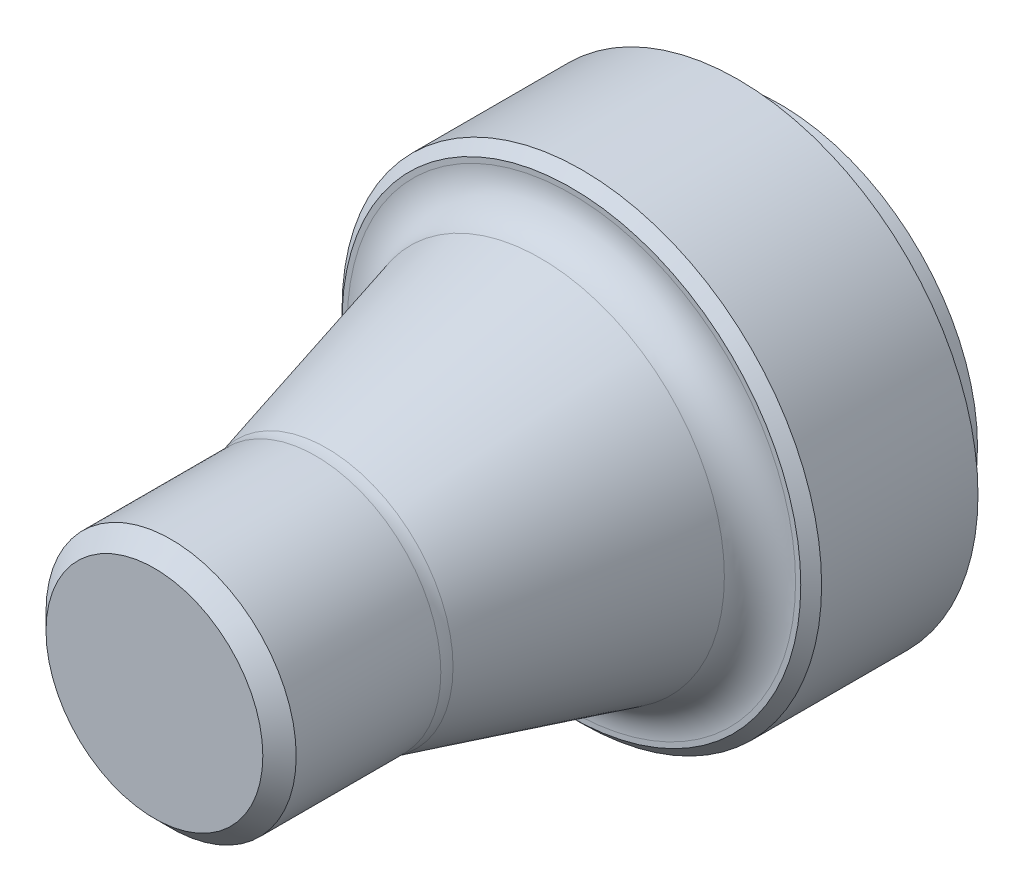
ISO-10303-21;
HEADER;
FILE_DESCRIPTION(('STEP AP214'),'2;1');
FILE_NAME('part.step','',(''),(''),'','','');
FILE_SCHEMA(('AUTOMOTIVE_DESIGN { 1 0 10303 214 1 1 1 1 }'));
ENDSEC;
DATA;
#1=APPLICATION_CONTEXT('core data for automotive mechanical design processes');
#2=APPLICATION_PROTOCOL_DEFINITION('international standard','automotive_design',2000,#1);
#3=PRODUCT_CONTEXT('',#1,'mechanical');
#4=PRODUCT('Part','Part','',(#3));
#5=PRODUCT_RELATED_PRODUCT_CATEGORY('part','',(#4));
#6=PRODUCT_DEFINITION_FORMATION('','',#4);
#7=PRODUCT_DEFINITION_CONTEXT('part definition',#1,'design');
#8=PRODUCT_DEFINITION('design','',#6,#7);
#9=PRODUCT_DEFINITION_SHAPE('','',#8);
#10=(LENGTH_UNIT() NAMED_UNIT(*) SI_UNIT(.MILLI.,.METRE.));
#11=(NAMED_UNIT(*) PLANE_ANGLE_UNIT() SI_UNIT($,.RADIAN.));
#12=(NAMED_UNIT(*) SI_UNIT($,.STERADIAN.) SOLID_ANGLE_UNIT());
#13=UNCERTAINTY_MEASURE_WITH_UNIT(LENGTH_MEASURE(1.E-05),#10,'distance_accuracy_value','');
#14=(GEOMETRIC_REPRESENTATION_CONTEXT(3) GLOBAL_UNCERTAINTY_ASSIGNED_CONTEXT((#13)) GLOBAL_UNIT_ASSIGNED_CONTEXT((#10,
#11,#12)) REPRESENTATION_CONTEXT('',''));
#15=CARTESIAN_POINT('',(0.,0.,0.));
#16=DIRECTION('',(0.,0.,1.));
#17=DIRECTION('',(1.,0.,0.));
#18=AXIS2_PLACEMENT_3D('',#15,#16,#17);
#19=CARTESIAN_POINT('',(0.,7.7715611723761E-13,-6.35000000000097));
#20=DIRECTION('',(0.,0.,1.));
#21=DIRECTION('',(1.,0.,0.));
#22=AXIS2_PLACEMENT_3D('',#19,#20,#21);
#23=CYLINDRICAL_SURFACE('',#22,30.0863);
#24=CARTESIAN_POINT('',(0.,7.7715611723761E-13,-6.35000000000097));
#25=DIRECTION('',(0.,0.,1.));
#26=DIRECTION('',(1.,0.,0.));
#27=AXIS2_PLACEMENT_3D('',#24,#25,#26);
#28=CIRCLE('',#27,30.0863);
#29=CARTESIAN_POINT('',(30.0863,7.7715611723761E-13,-6.35000000000097));
#30=VERTEX_POINT('',#29);
#31=EDGE_CURVE('E65',#30,#30,#28,.T.);
#32=ORIENTED_EDGE('',*,*,#31,.T.);
#33=EDGE_LOOP('',(#32));
#34=FACE_BOUND('',#33,.T.);
#35=CARTESIAN_POINT('',(0.,0.,0.));
#36=DIRECTION('',(0.,0.,1.));
#37=DIRECTION('',(1.,0.,0.));
#38=AXIS2_PLACEMENT_3D('',#35,#36,#37);
#39=CIRCLE('',#38,30.0863);
#40=CARTESIAN_POINT('',(30.0863,0.,0.));
#41=VERTEX_POINT('',#40);
#42=EDGE_CURVE('E66',#41,#41,#39,.T.);
#43=ORIENTED_EDGE('',*,*,#42,.F.);
#44=EDGE_LOOP('',(#43));
#45=FACE_BOUND('',#44,.T.);
#46=ADVANCED_FACE('F33',(#34,#45),#23,.T.);
#47=CARTESIAN_POINT('',(0.,7.7715611723761E-13,-6.35000000000097));
#48=DIRECTION('',(0.,0.,1.));
#49=DIRECTION('',(1.,0.,0.));
#50=AXIS2_PLACEMENT_3D('',#47,#48,#49);
#51=PLANE('',#50);
#52=ORIENTED_EDGE('',*,*,#31,.F.);
#53=EDGE_LOOP('',(#52));
#54=FACE_BOUND('',#53,.T.);
#55=ADVANCED_FACE('F93',(#54),#51,.F.);
#56=CARTESIAN_POINT('',(0.,1.0547118733939E-12,25.399999999999));
#57=DIRECTION('',(0.,0.,-1.));
#58=DIRECTION('',(-1.,0.,0.));
#59=AXIS2_PLACEMENT_3D('',#56,#57,#58);
#60=CYLINDRICAL_SURFACE('',#59,36.5125);
#61=CARTESIAN_POINT('',(0.,6.66133814775094E-13,23.8124999999987));
#62=DIRECTION('',(0.,0.,1.));
#63=DIRECTION('',(1.,0.,0.));
#64=AXIS2_PLACEMENT_3D('',#61,#62,#63);
#65=CIRCLE('',#64,36.5125);
#66=CARTESIAN_POINT('',(36.5125,6.66133814775094E-13,23.8124999999987));
#67=VERTEX_POINT('',#66);
#68=EDGE_CURVE('E10',#67,#67,#65,.F.);
#69=ORIENTED_EDGE('',*,*,#68,.T.);
#70=EDGE_LOOP('',(#69));
#71=FACE_BOUND('',#70,.T.);
#72=CARTESIAN_POINT('',(0.,0.,0.));
#73=DIRECTION('',(0.,0.,1.));
#74=DIRECTION('',(1.,0.,0.));
#75=AXIS2_PLACEMENT_3D('',#72,#73,#74);
#76=CIRCLE('',#75,36.5125);
#77=CARTESIAN_POINT('',(36.5125,0.,0.));
#78=VERTEX_POINT('',#77);
#79=EDGE_CURVE('E69',#78,#78,#76,.T.);
#80=ORIENTED_EDGE('',*,*,#79,.T.);
#81=EDGE_LOOP('',(#80));
#82=FACE_BOUND('',#81,.T.);
#83=ADVANCED_FACE('F75',(#71,#82),#60,.T.);
#84=CARTESIAN_POINT('',(0.,1.0547118733939E-12,25.399999999999));
#85=DIRECTION('',(0.,0.,1.));
#86=DIRECTION('',(1.,0.,0.));
#87=AXIS2_PLACEMENT_3D('',#84,#85,#86);
#88=PLANE('',#87);
#89=CARTESIAN_POINT('',(0.,1.0547118733939E-12,25.399999999999));
#90=DIRECTION('',(0.,0.,1.));
#91=DIRECTION('',(1.,0.,0.));
#92=AXIS2_PLACEMENT_3D('',#89,#90,#91);
#93=CIRCLE('',#92,34.925);
#94=CARTESIAN_POINT('',(34.925,1.0547118733939E-12,25.399999999999));
#95=VERTEX_POINT('',#94);
#96=EDGE_CURVE('E40',#95,#95,#93,.T.);
#97=ORIENTED_EDGE('',*,*,#96,.T.);
#98=EDGE_LOOP('',(#97));
#99=FACE_BOUND('',#98,.T.);
#100=CARTESIAN_POINT('',(0.,1.0547118733939E-12,25.399999999999));
#101=DIRECTION('',(0.,0.,1.));
#102=DIRECTION('',(1.,0.,0.));
#103=AXIS2_PLACEMENT_3D('',#100,#101,#102);
#104=CIRCLE('',#103,34.1313906052922);
#105=CARTESIAN_POINT('',(34.1313906052922,1.0547118733939E-12,25.399999999999));
#106=VERTEX_POINT('',#105);
#107=EDGE_CURVE('E48',#106,#106,#104,.F.);
#108=ORIENTED_EDGE('',*,*,#107,.T.);
#109=EDGE_LOOP('',(#108));
#110=FACE_BOUND('',#109,.T.);
#111=ADVANCED_FACE('F80',(#99,#110),#88,.T.);
#112=CARTESIAN_POINT('',(0.,0.,0.));
#113=DIRECTION('',(0.,0.,1.));
#114=DIRECTION('',(1.,0.,0.));
#115=AXIS2_PLACEMENT_3D('',#112,#113,#114);
#116=PLANE('',#115);
#117=ORIENTED_EDGE('',*,*,#42,.T.);
#118=EDGE_LOOP('',(#117));
#119=FACE_BOUND('',#118,.T.);
#120=ORIENTED_EDGE('',*,*,#79,.F.);
#121=EDGE_LOOP('',(#120));
#122=FACE_BOUND('',#121,.T.);
#123=ADVANCED_FACE('F77',(#119,#122),#116,.F.);
#124=CARTESIAN_POINT('',(-1.16573417585641E-12,3.33066907387547E-13,63.4999999999999));
#125=DIRECTION('',(0.,0.,-1.));
#126=DIRECTION('',(1.,0.,0.));
#127=AXIS2_PLACEMENT_3D('',#124,#125,#126);
#128=CONICAL_SURFACE('',#127,19.05,0.26179938779915);
#129=CARTESIAN_POINT('',(7.7715611723761E-13,3.88578058618805E-13,30.1064990635984));
#130=DIRECTION('',(0.,0.,1.));
#131=DIRECTION('',(1.,0.,0.));
#132=AXIS2_PLACEMENT_3D('',#129,#130,#131);
#133=CIRCLE('',#132,27.9977616083566);
#134=CARTESIAN_POINT('',(27.9977616083574,3.88578058618805E-13,30.1064990635984));
#135=VERTEX_POINT('',#134);
#136=EDGE_CURVE('E53',#135,#135,#133,.T.);
#137=ORIENTED_EDGE('',*,*,#136,.T.);
#138=EDGE_LOOP('',(#137));
#139=FACE_BOUND('',#138,.T.);
#140=CARTESIAN_POINT('',(-1.16573417585641E-12,4.9960036108132E-13,62.6924924232787));
#141=DIRECTION('',(0.,0.,-1.));
#142=DIRECTION('',(-1.,0.,0.));
#143=AXIS2_PLACEMENT_3D('',#140,#141,#142);
#144=CIRCLE('',#143,19.2663710030644);
#145=CARTESIAN_POINT('',(-19.2663710030656,4.9960036108132E-13,62.6924924232787));
#146=VERTEX_POINT('',#145);
#147=EDGE_CURVE('E56',#146,#146,#144,.T.);
#148=ORIENTED_EDGE('',*,*,#147,.T.);
#149=EDGE_LOOP('',(#148));
#150=FACE_BOUND('',#149,.T.);
#151=ADVANCED_FACE('F79',(#139,#150),#128,.T.);
#152=CARTESIAN_POINT('',(0.,2.22044604925031E-13,88.9000000000002));
#153=DIRECTION('',(0.,0.,-1.));
#154=DIRECTION('',(-1.,0.,0.));
#155=AXIS2_PLACEMENT_3D('',#152,#153,#154);
#156=CYLINDRICAL_SURFACE('',#155,19.05);
#157=CARTESIAN_POINT('',(-1.16573417585641E-12,3.88578058618805E-13,64.3359933596794));
#158=DIRECTION('',(0.,0.,1.));
#159=DIRECTION('',(1.,0.,0.));
#160=AXIS2_PLACEMENT_3D('',#157,#158,#159);
#161=CIRCLE('',#160,19.05);
#162=CARTESIAN_POINT('',(19.0499999999988,3.88578058618805E-13,64.3359933596794));
#163=VERTEX_POINT('',#162);
#164=EDGE_CURVE('E44',#163,#163,#161,.T.);
#165=ORIENTED_EDGE('',*,*,#164,.T.);
#166=EDGE_LOOP('',(#165));
#167=FACE_BOUND('',#166,.T.);
#168=CARTESIAN_POINT('',(1.16573417585641E-12,1.66533453693773E-13,86.3600000000004));
#169=DIRECTION('',(0.,0.,1.));
#170=DIRECTION('',(1.,0.,0.));
#171=AXIS2_PLACEMENT_3D('',#168,#169,#170);
#172=CIRCLE('',#171,19.05);
#173=CARTESIAN_POINT('',(19.0500000000012,1.66533453693774E-13,86.3600000000004));
#174=VERTEX_POINT('',#173);
#175=EDGE_CURVE('E59',#174,#174,#172,.F.);
#176=ORIENTED_EDGE('',*,*,#175,.T.);
#177=EDGE_LOOP('',(#176));
#178=FACE_BOUND('',#177,.T.);
#179=ADVANCED_FACE('F87',(#167,#178),#156,.T.);
#180=CARTESIAN_POINT('',(0.,2.22044604925031E-13,88.9000000000002));
#181=DIRECTION('',(0.,0.,1.));
#182=DIRECTION('',(1.,0.,0.));
#183=AXIS2_PLACEMENT_3D('',#180,#181,#182);
#184=PLANE('',#183);
#185=CARTESIAN_POINT('',(0.,2.22044604925031E-13,88.9000000000002));
#186=DIRECTION('',(0.,0.,1.));
#187=DIRECTION('',(1.,0.,0.));
#188=AXIS2_PLACEMENT_3D('',#185,#186,#187);
#189=CIRCLE('',#188,16.51);
#190=CARTESIAN_POINT('',(16.51,2.22044604925031E-13,88.9000000000002));
#191=VERTEX_POINT('',#190);
#192=EDGE_CURVE('E62',#191,#191,#189,.T.);
#193=ORIENTED_EDGE('',*,*,#192,.T.);
#194=EDGE_LOOP('',(#193));
#195=FACE_BOUND('',#194,.T.);
#196=ADVANCED_FACE('F107',(#195),#184,.T.);
#197=CARTESIAN_POINT('',(0.,2.22044604925031E-13,88.9000000000002));
#198=DIRECTION('',(0.,0.,-1.));
#199=DIRECTION('',(-1.,0.,0.));
#200=AXIS2_PLACEMENT_3D('',#197,#198,#199);
#201=CONICAL_SURFACE('',#200,16.51,0.785398163397446);
#202=ORIENTED_EDGE('',*,*,#175,.F.);
#203=EDGE_LOOP('',(#202));
#204=FACE_BOUND('',#203,.T.);
#205=ORIENTED_EDGE('',*,*,#192,.F.);
#206=EDGE_LOOP('',(#205));
#207=FACE_BOUND('',#206,.T.);
#208=ADVANCED_FACE('F103',(#204,#207),#201,.T.);
#209=CARTESIAN_POINT('',(7.7715611723761E-13,0.,31.7499999999995));
#210=DIRECTION('',(0.,0.,1.));
#211=DIRECTION('',(1.,0.,0.));
#212=AXIS2_PLACEMENT_3D('',#209,#210,#211);
#213=TOROIDAL_SURFACE('',#212,34.1313906052922,6.35);
#214=ORIENTED_EDGE('',*,*,#107,.F.);
#215=EDGE_LOOP('',(#214));
#216=FACE_BOUND('',#215,.T.);
#217=ORIENTED_EDGE('',*,*,#136,.F.);
#218=EDGE_LOOP('',(#217));
#219=FACE_BOUND('',#218,.T.);
#220=ADVANCED_FACE('F106',(#216,#219),#213,.F.);
#221=CARTESIAN_POINT('',(-1.16573417585641E-12,3.88578058618805E-13,64.3359933596794));
#222=DIRECTION('',(0.,0.,1.));
#223=DIRECTION('',(1.,0.,0.));
#224=AXIS2_PLACEMENT_3D('',#221,#222,#223);
#225=TOROIDAL_SURFACE('',#224,25.4,6.35);
#226=ORIENTED_EDGE('',*,*,#147,.F.);
#227=EDGE_LOOP('',(#226));
#228=FACE_BOUND('',#227,.T.);
#229=ORIENTED_EDGE('',*,*,#164,.F.);
#230=EDGE_LOOP('',(#229));
#231=FACE_BOUND('',#230,.T.);
#232=ADVANCED_FACE('F110',(#228,#231),#225,.F.);
#233=CARTESIAN_POINT('',(0.,1.0547118733939E-12,25.399999999999));
#234=DIRECTION('',(0.,0.,-1.));
#235=DIRECTION('',(-1.,0.,0.));
#236=AXIS2_PLACEMENT_3D('',#233,#234,#235);
#237=CONICAL_SURFACE('',#236,34.925,0.785398163397444);
#238=ORIENTED_EDGE('',*,*,#68,.F.);
#239=EDGE_LOOP('',(#238));
#240=FACE_BOUND('',#239,.T.);
#241=ORIENTED_EDGE('',*,*,#96,.F.);
#242=EDGE_LOOP('',(#241));
#243=FACE_BOUND('',#242,.T.);
#244=ADVANCED_FACE('F35',(#240,#243),#237,.T.);
#245=CLOSED_SHELL('',(#46,#55,#83,#111,#123,#151,#179,#196,#208,#220,#232,#244));
#246=MANIFOLD_SOLID_BREP('B2',#245);
#247=ADVANCED_BREP_SHAPE_REPRESENTATION('',(#18,#246),#14);
#248=SHAPE_DEFINITION_REPRESENTATION(#9,#247);
ENDSEC;
END-ISO-10303-21;
